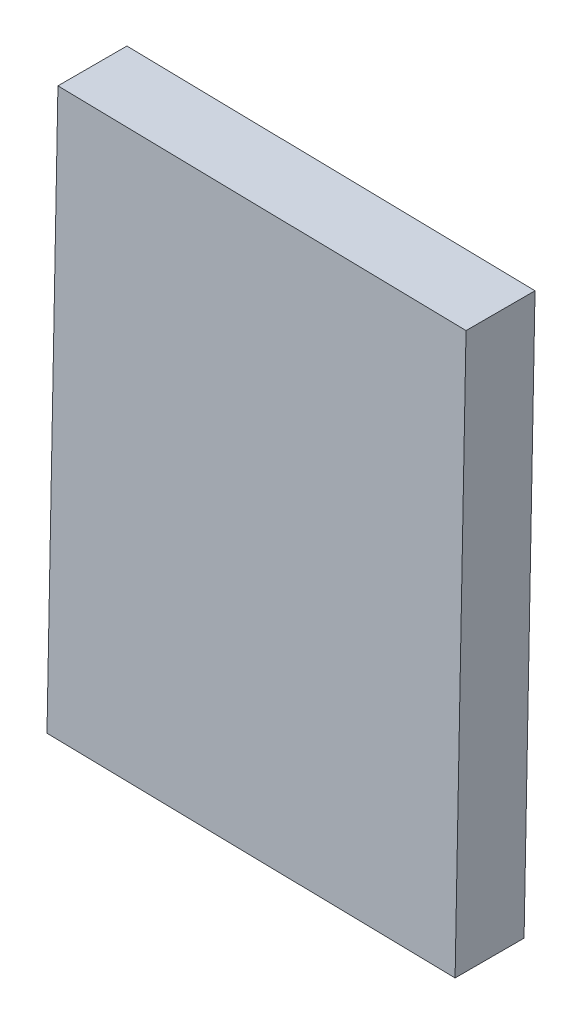
ISO-10303-21;
HEADER;
FILE_DESCRIPTION(('STEP AP214'),'2;1');
FILE_NAME('part.step','',(''),(''),'','','');
FILE_SCHEMA(('AUTOMOTIVE_DESIGN { 1 0 10303 214 1 1 1 1 }'));
ENDSEC;
DATA;
#1=APPLICATION_CONTEXT('core data for automotive mechanical design processes');
#2=APPLICATION_PROTOCOL_DEFINITION('international standard','automotive_design',2000,#1);
#3=PRODUCT_CONTEXT('',#1,'mechanical');
#4=PRODUCT('Part','Part','',(#3));
#5=PRODUCT_RELATED_PRODUCT_CATEGORY('part','',(#4));
#6=PRODUCT_DEFINITION_FORMATION('','',#4);
#7=PRODUCT_DEFINITION_CONTEXT('part definition',#1,'design');
#8=PRODUCT_DEFINITION('design','',#6,#7);
#9=PRODUCT_DEFINITION_SHAPE('','',#8);
#10=(LENGTH_UNIT() NAMED_UNIT(*) SI_UNIT(.MILLI.,.METRE.));
#11=(NAMED_UNIT(*) PLANE_ANGLE_UNIT() SI_UNIT($,.RADIAN.));
#12=(NAMED_UNIT(*) SI_UNIT($,.STERADIAN.) SOLID_ANGLE_UNIT());
#13=UNCERTAINTY_MEASURE_WITH_UNIT(LENGTH_MEASURE(1.E-05),#10,'distance_accuracy_value','');
#14=(GEOMETRIC_REPRESENTATION_CONTEXT(3) GLOBAL_UNCERTAINTY_ASSIGNED_CONTEXT((#13)) GLOBAL_UNIT_ASSIGNED_CONTEXT((#10,
#11,#12)) REPRESENTATION_CONTEXT('',''));
#15=CARTESIAN_POINT('',(0.,0.,0.));
#16=DIRECTION('',(0.,0.,1.));
#17=DIRECTION('',(1.,0.,0.));
#18=AXIS2_PLACEMENT_3D('',#15,#16,#17);
#19=CARTESIAN_POINT('',(-1.69169808418193,1.84838383607335,34.7010965279299));
#20=DIRECTION('',(0.,0.,1.));
#21=DIRECTION('',(0.999812677663925,-0.0193548335692301,0.));
#22=AXIS2_PLACEMENT_3D('',#19,#20,#21);
#23=PLANE('',#22);
#24=DIRECTION('',(0.0193548335692301,0.999812677663925,0.));
#25=VECTOR('',#24,1.);
#26=CARTESIAN_POINT('',(-10.9491282892118,-10.4842503208698,34.7010965279297));
#27=LINE('',#26,#25);
#28=CARTESIAN_POINT('',(-10.9491282892118,-10.4842503208698,34.7010965279297));
#29=VERTEX_POINT('',#28);
#30=CARTESIAN_POINT('',(-10.4648897081432,14.530063061604,34.7010965279294));
#31=VERTEX_POINT('',#30);
#32=EDGE_CURVE('E58',#29,#31,#27,.T.);
#33=ORIENTED_EDGE('',*,*,#32,.T.);
#34=DIRECTION('',(0.999812677663925,-0.0193548335692299,0.));
#35=VECTOR('',#34,1.);
#36=CARTESIAN_POINT('',(-10.4648897081432,14.530063061604,34.7010965279294));
#37=LINE('',#36,#35);
#38=CARTESIAN_POINT('',(7.56573212084797,14.1810179930165,34.70109652793));
#39=VERTEX_POINT('',#38);
#40=EDGE_CURVE('E20',#31,#39,#37,.T.);
#41=ORIENTED_EDGE('',*,*,#40,.T.);
#42=DIRECTION('',(-0.0193548335692301,-0.999812677663925,0.));
#43=VECTOR('',#42,1.);
#44=CARTESIAN_POINT('',(7.0814935397794,-10.8332953894573,34.7010965279303));
#45=LINE('',#44,#43);
#46=CARTESIAN_POINT('',(7.0814935397794,-10.8332953894573,34.7010965279303));
#47=VERTEX_POINT('',#46);
#48=EDGE_CURVE('E88',#39,#47,#45,.T.);
#49=ORIENTED_EDGE('',*,*,#48,.T.);
#50=DIRECTION('',(-0.999812677663925,0.0193548335692299,0.));
#51=VECTOR('',#50,1.);
#52=CARTESIAN_POINT('',(-10.9491282892118,-10.4842503208698,34.7010965279297));
#53=LINE('',#52,#51);
#54=EDGE_CURVE('E56',#47,#29,#53,.T.);
#55=ORIENTED_EDGE('',*,*,#54,.T.);
#56=EDGE_LOOP('',(#33,#41,#49,#55));
#57=FACE_BOUND('',#56,.T.);
#58=ADVANCED_FACE('F17',(#57),#23,.F.);
#59=CARTESIAN_POINT('',(-10.4648897081433,14.530063061604,37.7490965279294));
#60=DIRECTION('',(-0.0193548335692299,-0.999812677663925,0.));
#61=DIRECTION('',(0.999812677663925,-0.0193548335692299,0.));
#62=AXIS2_PLACEMENT_3D('',#59,#60,#61);
#63=PLANE('',#62);
#64=DIRECTION('',(0.,0.,1.));
#65=VECTOR('',#64,1.);
#66=CARTESIAN_POINT('',(7.56573212084787,14.1810179930165,37.74909652793));
#67=LINE('',#66,#65);
#68=CARTESIAN_POINT('',(7.56573212084787,14.1810179930165,37.74909652793));
#69=VERTEX_POINT('',#68);
#70=EDGE_CURVE('E70',#69,#39,#67,.F.);
#71=ORIENTED_EDGE('',*,*,#70,.T.);
#72=ORIENTED_EDGE('',*,*,#40,.F.);
#73=DIRECTION('',(0.,0.,1.));
#74=VECTOR('',#73,1.);
#75=CARTESIAN_POINT('',(-10.4648897081433,14.530063061604,37.7490965279294));
#76=LINE('',#75,#74);
#77=CARTESIAN_POINT('',(-10.4648897081433,14.530063061604,37.7490965279294));
#78=VERTEX_POINT('',#77);
#79=EDGE_CURVE('E65',#31,#78,#76,.T.);
#80=ORIENTED_EDGE('',*,*,#79,.T.);
#81=DIRECTION('',(0.999812677663925,-0.0193548335692301,0.));
#82=VECTOR('',#81,1.);
#83=CARTESIAN_POINT('',(-1.44957879364774,14.3555405273103,37.7490965279297));
#84=LINE('',#83,#82);
#85=EDGE_CURVE('E93',#69,#78,#84,.F.);
#86=ORIENTED_EDGE('',*,*,#85,.F.);
#87=EDGE_LOOP('',(#71,#72,#80,#86));
#88=FACE_BOUND('',#87,.T.);
#89=ADVANCED_FACE('F67',(#88),#63,.F.);
#90=CARTESIAN_POINT('',(-10.9491282892119,-10.4842503208697,37.7490965279298));
#91=DIRECTION('',(0.999812677663925,-0.0193548335692301,0.));
#92=DIRECTION('',(0.0193548335692301,0.999812677663925,0.));
#93=AXIS2_PLACEMENT_3D('',#90,#91,#92);
#94=PLANE('',#93);
#95=ORIENTED_EDGE('',*,*,#79,.F.);
#96=ORIENTED_EDGE('',*,*,#32,.F.);
#97=DIRECTION('',(0.,0.,1.));
#98=VECTOR('',#97,1.);
#99=CARTESIAN_POINT('',(-10.9491282892119,-10.4842503208697,37.7490965279298));
#100=LINE('',#99,#98);
#101=CARTESIAN_POINT('',(-10.9491282892119,-10.4842503208697,37.7490965279298));
#102=VERTEX_POINT('',#101);
#103=EDGE_CURVE('E81',#29,#102,#100,.T.);
#104=ORIENTED_EDGE('',*,*,#103,.T.);
#105=DIRECTION('',(0.0193548335692301,0.999812677663925,0.));
#106=VECTOR('',#105,1.);
#107=CARTESIAN_POINT('',(-10.7070089986776,2.02290637036714,37.7490965279296));
#108=LINE('',#107,#106);
#109=EDGE_CURVE('E75',#78,#102,#108,.F.);
#110=ORIENTED_EDGE('',*,*,#109,.F.);
#111=EDGE_LOOP('',(#95,#96,#104,#110));
#112=FACE_BOUND('',#111,.T.);
#113=ADVANCED_FACE('F73',(#112),#94,.F.);
#114=CARTESIAN_POINT('',(-10.9491282892119,-10.4842503208697,37.7490965279298));
#115=DIRECTION('',(0.0193548335692299,0.999812677663925,0.));
#116=DIRECTION('',(-0.999812677663925,0.0193548335692299,0.));
#117=AXIS2_PLACEMENT_3D('',#114,#115,#116);
#118=PLANE('',#117);
#119=ORIENTED_EDGE('',*,*,#103,.F.);
#120=ORIENTED_EDGE('',*,*,#54,.F.);
#121=DIRECTION('',(0.,0.,1.));
#122=VECTOR('',#121,1.);
#123=CARTESIAN_POINT('',(7.0814935397793,-10.8332953894572,37.7490965279303));
#124=LINE('',#123,#122);
#125=CARTESIAN_POINT('',(7.0814935397793,-10.8332953894572,37.7490965279303));
#126=VERTEX_POINT('',#125);
#127=EDGE_CURVE('E36',#47,#126,#124,.T.);
#128=ORIENTED_EDGE('',*,*,#127,.T.);
#129=DIRECTION('',(0.999812677663925,-0.0193548335692301,0.));
#130=VECTOR('',#129,1.);
#131=CARTESIAN_POINT('',(-1.93381737471631,-10.6587728551635,37.74909652793));
#132=LINE('',#131,#130);
#133=EDGE_CURVE('E27',#102,#126,#132,.T.);
#134=ORIENTED_EDGE('',*,*,#133,.F.);
#135=EDGE_LOOP('',(#119,#120,#128,#134));
#136=FACE_BOUND('',#135,.T.);
#137=ADVANCED_FACE('F102',(#136),#118,.F.);
#138=CARTESIAN_POINT('',(7.0814935397793,-10.8332953894572,37.7490965279303));
#139=DIRECTION('',(-0.999812677663925,0.0193548335692301,0.));
#140=DIRECTION('',(-0.0193548335692301,-0.999812677663925,0.));
#141=AXIS2_PLACEMENT_3D('',#138,#139,#140);
#142=PLANE('',#141);
#143=ORIENTED_EDGE('',*,*,#127,.F.);
#144=ORIENTED_EDGE('',*,*,#48,.F.);
#145=ORIENTED_EDGE('',*,*,#70,.F.);
#146=DIRECTION('',(0.0193548335692301,0.999812677663925,0.));
#147=VECTOR('',#146,1.);
#148=CARTESIAN_POINT('',(7.32361283031359,1.67386130177965,37.7490965279302));
#149=LINE('',#148,#147);
#150=EDGE_CURVE('E11',#126,#69,#149,.T.);
#151=ORIENTED_EDGE('',*,*,#150,.F.);
#152=EDGE_LOOP('',(#143,#144,#145,#151));
#153=FACE_BOUND('',#152,.T.);
#154=ADVANCED_FACE('F104',(#153),#142,.F.);
#155=CARTESIAN_POINT('',(-1.69169808418203,1.8483838360734,37.7490965279299));
#156=DIRECTION('',(0.,0.,1.));
#157=DIRECTION('',(0.999812677663925,-0.0193548335692301,0.));
#158=AXIS2_PLACEMENT_3D('',#155,#156,#157);
#159=PLANE('',#158);
#160=ORIENTED_EDGE('',*,*,#133,.T.);
#161=ORIENTED_EDGE('',*,*,#150,.T.);
#162=ORIENTED_EDGE('',*,*,#85,.T.);
#163=ORIENTED_EDGE('',*,*,#109,.T.);
#164=EDGE_LOOP('',(#160,#161,#162,#163));
#165=FACE_BOUND('',#164,.T.);
#166=ADVANCED_FACE('F101',(#165),#159,.T.);
#167=CLOSED_SHELL('',(#58,#89,#113,#137,#154,#166));
#168=MANIFOLD_SOLID_BREP('B1',#167);
#169=ADVANCED_BREP_SHAPE_REPRESENTATION('',(#18,#168),#14);
#170=SHAPE_DEFINITION_REPRESENTATION(#9,#169);
ENDSEC;
END-ISO-10303-21;
